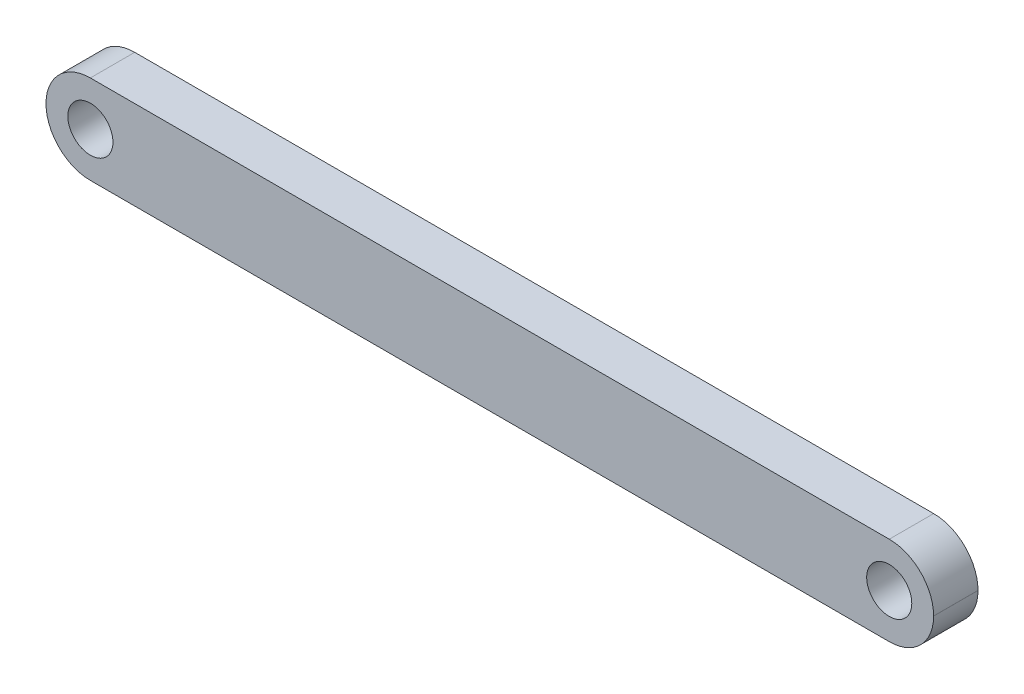
ISO-10303-21;
HEADER;
FILE_DESCRIPTION(('STEP AP214'),'2;1');
FILE_NAME('part.step','',(''),(''),'','','');
FILE_SCHEMA(('AUTOMOTIVE_DESIGN { 1 0 10303 214 1 1 1 1 }'));
ENDSEC;
DATA;
#1=APPLICATION_CONTEXT('core data for automotive mechanical design processes');
#2=APPLICATION_PROTOCOL_DEFINITION('international standard','automotive_design',2000,#1);
#3=PRODUCT_CONTEXT('',#1,'mechanical');
#4=PRODUCT('Part','Part','',(#3));
#5=PRODUCT_RELATED_PRODUCT_CATEGORY('part','',(#4));
#6=PRODUCT_DEFINITION_FORMATION('','',#4);
#7=PRODUCT_DEFINITION_CONTEXT('part definition',#1,'design');
#8=PRODUCT_DEFINITION('design','',#6,#7);
#9=PRODUCT_DEFINITION_SHAPE('','',#8);
#10=(LENGTH_UNIT() NAMED_UNIT(*) SI_UNIT(.MILLI.,.METRE.));
#11=(NAMED_UNIT(*) PLANE_ANGLE_UNIT() SI_UNIT($,.RADIAN.));
#12=(NAMED_UNIT(*) SI_UNIT($,.STERADIAN.) SOLID_ANGLE_UNIT());
#13=UNCERTAINTY_MEASURE_WITH_UNIT(LENGTH_MEASURE(1.E-05),#10,'distance_accuracy_value','');
#14=(GEOMETRIC_REPRESENTATION_CONTEXT(3) GLOBAL_UNCERTAINTY_ASSIGNED_CONTEXT((#13)) GLOBAL_UNIT_ASSIGNED_CONTEXT((#10,
#11,#12)) REPRESENTATION_CONTEXT('',''));
#15=CARTESIAN_POINT('',(0.,0.,0.));
#16=DIRECTION('',(0.,0.,1.));
#17=DIRECTION('',(1.,0.,0.));
#18=AXIS2_PLACEMENT_3D('',#15,#16,#17);
#19=CARTESIAN_POINT('',(12.49,12.51,12.5));
#20=DIRECTION('',(0.,0.,-1.));
#21=DIRECTION('',(-1.,0.,0.));
#22=AXIS2_PLACEMENT_3D('',#19,#20,#21);
#23=CYLINDRICAL_SURFACE('',#22,12.49);
#24=CARTESIAN_POINT('',(12.49,12.51,0.));
#25=DIRECTION('',(0.,0.,1.));
#26=DIRECTION('',(1.,0.,0.));
#27=AXIS2_PLACEMENT_3D('',#24,#25,#26);
#28=CIRCLE('',#27,12.49);
#29=CARTESIAN_POINT('',(0.,12.5099999999999,0.));
#30=VERTEX_POINT('',#29);
#31=CARTESIAN_POINT('',(12.4900000000001,25.,0.));
#32=VERTEX_POINT('',#31);
#33=EDGE_CURVE('E147',#30,#32,#28,.F.);
#34=ORIENTED_EDGE('',*,*,#33,.F.);
#35=DIRECTION('',(0.,0.,-1.));
#36=VECTOR('',#35,1.);
#37=CARTESIAN_POINT('',(0.,12.5099999999999,12.5));
#38=LINE('',#37,#36);
#39=CARTESIAN_POINT('',(0.,12.5099999999999,12.5));
#40=VERTEX_POINT('',#39);
#41=EDGE_CURVE('E11',#40,#30,#38,.T.);
#42=ORIENTED_EDGE('',*,*,#41,.F.);
#43=CARTESIAN_POINT('',(12.49,12.51,12.5));
#44=DIRECTION('',(0.,0.,1.));
#45=DIRECTION('',(1.,0.,0.));
#46=AXIS2_PLACEMENT_3D('',#43,#44,#45);
#47=CIRCLE('',#46,12.49);
#48=CARTESIAN_POINT('',(12.4900000000001,25.,12.5));
#49=VERTEX_POINT('',#48);
#50=EDGE_CURVE('E214',#40,#49,#47,.F.);
#51=ORIENTED_EDGE('',*,*,#50,.T.);
#52=DIRECTION('',(0.,0.,-1.));
#53=VECTOR('',#52,1.);
#54=CARTESIAN_POINT('',(12.4900000000001,25.,12.5));
#55=LINE('',#54,#53);
#56=EDGE_CURVE('E59',#49,#32,#55,.T.);
#57=ORIENTED_EDGE('',*,*,#56,.T.);
#58=EDGE_LOOP('',(#34,#42,#51,#57));
#59=FACE_BOUND('',#58,.T.);
#60=ADVANCED_FACE('F41',(#59),#23,.T.);
#61=CARTESIAN_POINT('',(0.,0.,12.5));
#62=DIRECTION('',(-1.,0.,0.));
#63=DIRECTION('',(0.,0.,1.));
#64=AXIS2_PLACEMENT_3D('',#61,#62,#63);
#65=PLANE('',#64);
#66=DIRECTION('',(0.,1.,0.));
#67=VECTOR('',#66,1.);
#68=CARTESIAN_POINT('',(0.,0.,0.));
#69=LINE('',#68,#67);
#70=CARTESIAN_POINT('',(0.,12.4900000000001,0.));
#71=VERTEX_POINT('',#70);
#72=EDGE_CURVE('E150',#71,#30,#69,.T.);
#73=ORIENTED_EDGE('',*,*,#72,.F.);
#74=DIRECTION('',(0.,0.,-1.));
#75=VECTOR('',#74,1.);
#76=CARTESIAN_POINT('',(0.,12.4900000000001,12.5));
#77=LINE('',#76,#75);
#78=CARTESIAN_POINT('',(0.,12.4900000000001,12.5));
#79=VERTEX_POINT('',#78);
#80=EDGE_CURVE('E51',#79,#71,#77,.T.);
#81=ORIENTED_EDGE('',*,*,#80,.F.);
#82=DIRECTION('',(0.,1.,0.));
#83=VECTOR('',#82,1.);
#84=CARTESIAN_POINT('',(0.,0.,12.5));
#85=LINE('',#84,#83);
#86=EDGE_CURVE('E210',#79,#40,#85,.T.);
#87=ORIENTED_EDGE('',*,*,#86,.T.);
#88=ORIENTED_EDGE('',*,*,#41,.T.);
#89=EDGE_LOOP('',(#73,#81,#87,#88));
#90=FACE_BOUND('',#89,.T.);
#91=ADVANCED_FACE('F199',(#90),#65,.T.);
#92=CARTESIAN_POINT('',(12.49,12.49,12.5));
#93=DIRECTION('',(0.,0.,-1.));
#94=DIRECTION('',(-1.,0.,0.));
#95=AXIS2_PLACEMENT_3D('',#92,#93,#94);
#96=CYLINDRICAL_SURFACE('',#95,12.49);
#97=CARTESIAN_POINT('',(12.49,12.49,0.));
#98=DIRECTION('',(0.,0.,1.));
#99=DIRECTION('',(1.,0.,0.));
#100=AXIS2_PLACEMENT_3D('',#97,#98,#99);
#101=CIRCLE('',#100,12.49);
#102=CARTESIAN_POINT('',(12.4900000000001,0.,0.));
#103=VERTEX_POINT('',#102);
#104=EDGE_CURVE('E154',#103,#71,#101,.F.);
#105=ORIENTED_EDGE('',*,*,#104,.F.);
#106=DIRECTION('',(0.,0.,-1.));
#107=VECTOR('',#106,1.);
#108=CARTESIAN_POINT('',(12.4900000000001,0.,12.5));
#109=LINE('',#108,#107);
#110=CARTESIAN_POINT('',(12.4900000000001,0.,12.5));
#111=VERTEX_POINT('',#110);
#112=EDGE_CURVE('E186',#111,#103,#109,.T.);
#113=ORIENTED_EDGE('',*,*,#112,.F.);
#114=CARTESIAN_POINT('',(12.49,12.49,12.5));
#115=DIRECTION('',(0.,0.,1.));
#116=DIRECTION('',(1.,0.,0.));
#117=AXIS2_PLACEMENT_3D('',#114,#115,#116);
#118=CIRCLE('',#117,12.49);
#119=EDGE_CURVE('E195',#111,#79,#118,.F.);
#120=ORIENTED_EDGE('',*,*,#119,.T.);
#121=ORIENTED_EDGE('',*,*,#80,.T.);
#122=EDGE_LOOP('',(#105,#113,#120,#121));
#123=FACE_BOUND('',#122,.T.);
#124=ADVANCED_FACE('F193',(#123),#96,.T.);
#125=CARTESIAN_POINT('',(0.,0.,12.5));
#126=DIRECTION('',(0.,1.,0.));
#127=DIRECTION('',(0.,0.,1.));
#128=AXIS2_PLACEMENT_3D('',#125,#126,#127);
#129=PLANE('',#128);
#130=DIRECTION('',(1.,0.,0.));
#131=VECTOR('',#130,1.);
#132=CARTESIAN_POINT('',(0.,0.,0.));
#133=LINE('',#132,#131);
#134=CARTESIAN_POINT('',(237.51,0.,0.));
#135=VERTEX_POINT('',#134);
#136=EDGE_CURVE('E158',#103,#135,#133,.T.);
#137=ORIENTED_EDGE('',*,*,#136,.T.);
#138=DIRECTION('',(0.,0.,-1.));
#139=VECTOR('',#138,1.);
#140=CARTESIAN_POINT('',(237.51,0.,12.5));
#141=LINE('',#140,#139);
#142=CARTESIAN_POINT('',(237.51,0.,12.5));
#143=VERTEX_POINT('',#142);
#144=EDGE_CURVE('E182',#143,#135,#141,.T.);
#145=ORIENTED_EDGE('',*,*,#144,.F.);
#146=DIRECTION('',(1.,0.,0.));
#147=VECTOR('',#146,1.);
#148=CARTESIAN_POINT('',(0.,0.,12.5));
#149=LINE('',#148,#147);
#150=EDGE_CURVE('E207',#111,#143,#149,.T.);
#151=ORIENTED_EDGE('',*,*,#150,.F.);
#152=ORIENTED_EDGE('',*,*,#112,.T.);
#153=EDGE_LOOP('',(#137,#145,#151,#152));
#154=FACE_BOUND('',#153,.T.);
#155=ADVANCED_FACE('F205',(#154),#129,.F.);
#156=CARTESIAN_POINT('',(237.51,12.49,12.5));
#157=DIRECTION('',(0.,0.,-1.));
#158=DIRECTION('',(-1.,0.,0.));
#159=AXIS2_PLACEMENT_3D('',#156,#157,#158);
#160=CYLINDRICAL_SURFACE('',#159,12.49);
#161=CARTESIAN_POINT('',(237.51,12.49,0.));
#162=DIRECTION('',(0.,0.,1.));
#163=DIRECTION('',(1.,0.,0.));
#164=AXIS2_PLACEMENT_3D('',#161,#162,#163);
#165=CIRCLE('',#164,12.49);
#166=CARTESIAN_POINT('',(250.,12.4900000000001,0.));
#167=VERTEX_POINT('',#166);
#168=EDGE_CURVE('E162',#135,#167,#165,.T.);
#169=ORIENTED_EDGE('',*,*,#168,.T.);
#170=DIRECTION('',(0.,0.,-1.));
#171=VECTOR('',#170,1.);
#172=CARTESIAN_POINT('',(250.,12.4900000000001,12.5));
#173=LINE('',#172,#171);
#174=CARTESIAN_POINT('',(250.,12.4900000000001,12.5));
#175=VERTEX_POINT('',#174);
#176=EDGE_CURVE('E129',#175,#167,#173,.T.);
#177=ORIENTED_EDGE('',*,*,#176,.F.);
#178=CARTESIAN_POINT('',(237.51,12.49,12.5));
#179=DIRECTION('',(0.,0.,1.));
#180=DIRECTION('',(1.,0.,0.));
#181=AXIS2_PLACEMENT_3D('',#178,#179,#180);
#182=CIRCLE('',#181,12.49);
#183=EDGE_CURVE('E116',#143,#175,#182,.T.);
#184=ORIENTED_EDGE('',*,*,#183,.F.);
#185=ORIENTED_EDGE('',*,*,#144,.T.);
#186=EDGE_LOOP('',(#169,#177,#184,#185));
#187=FACE_BOUND('',#186,.T.);
#188=ADVANCED_FACE('F258',(#187),#160,.T.);
#189=CARTESIAN_POINT('',(250.,0.,12.5));
#190=DIRECTION('',(-1.,0.,0.));
#191=DIRECTION('',(0.,0.,1.));
#192=AXIS2_PLACEMENT_3D('',#189,#190,#191);
#193=PLANE('',#192);
#194=DIRECTION('',(0.,1.,0.));
#195=VECTOR('',#194,1.);
#196=CARTESIAN_POINT('',(250.,0.,0.));
#197=LINE('',#196,#195);
#198=CARTESIAN_POINT('',(250.,12.5099999999999,0.));
#199=VERTEX_POINT('',#198);
#200=EDGE_CURVE('E125',#167,#199,#197,.T.);
#201=ORIENTED_EDGE('',*,*,#200,.T.);
#202=DIRECTION('',(0.,0.,-1.));
#203=VECTOR('',#202,1.);
#204=CARTESIAN_POINT('',(250.,12.5099999999999,12.5));
#205=LINE('',#204,#203);
#206=CARTESIAN_POINT('',(250.,12.5099999999999,12.5));
#207=VERTEX_POINT('',#206);
#208=EDGE_CURVE('E123',#207,#199,#205,.T.);
#209=ORIENTED_EDGE('',*,*,#208,.F.);
#210=DIRECTION('',(0.,1.,0.));
#211=VECTOR('',#210,1.);
#212=CARTESIAN_POINT('',(250.,0.,12.5));
#213=LINE('',#212,#211);
#214=EDGE_CURVE('E109',#175,#207,#213,.T.);
#215=ORIENTED_EDGE('',*,*,#214,.F.);
#216=ORIENTED_EDGE('',*,*,#176,.T.);
#217=EDGE_LOOP('',(#201,#209,#215,#216));
#218=FACE_BOUND('',#217,.T.);
#219=ADVANCED_FACE('F124',(#218),#193,.F.);
#220=CARTESIAN_POINT('',(237.51,12.51,12.5));
#221=DIRECTION('',(0.,0.,-1.));
#222=DIRECTION('',(-1.,0.,0.));
#223=AXIS2_PLACEMENT_3D('',#220,#221,#222);
#224=CYLINDRICAL_SURFACE('',#223,12.49);
#225=CARTESIAN_POINT('',(237.51,12.51,0.));
#226=DIRECTION('',(0.,0.,1.));
#227=DIRECTION('',(1.,0.,0.));
#228=AXIS2_PLACEMENT_3D('',#225,#226,#227);
#229=CIRCLE('',#228,12.49);
#230=CARTESIAN_POINT('',(237.51,25.,0.));
#231=VERTEX_POINT('',#230);
#232=EDGE_CURVE('E168',#231,#199,#229,.F.);
#233=ORIENTED_EDGE('',*,*,#232,.F.);
#234=DIRECTION('',(0.,0.,-1.));
#235=VECTOR('',#234,1.);
#236=CARTESIAN_POINT('',(237.51,25.,12.5));
#237=LINE('',#236,#235);
#238=CARTESIAN_POINT('',(237.51,25.,12.5));
#239=VERTEX_POINT('',#238);
#240=EDGE_CURVE('E84',#239,#231,#237,.T.);
#241=ORIENTED_EDGE('',*,*,#240,.F.);
#242=CARTESIAN_POINT('',(237.51,12.51,12.5));
#243=DIRECTION('',(0.,0.,1.));
#244=DIRECTION('',(1.,0.,0.));
#245=AXIS2_PLACEMENT_3D('',#242,#243,#244);
#246=CIRCLE('',#245,12.49);
#247=EDGE_CURVE('E114',#239,#207,#246,.F.);
#248=ORIENTED_EDGE('',*,*,#247,.T.);
#249=ORIENTED_EDGE('',*,*,#208,.T.);
#250=EDGE_LOOP('',(#233,#241,#248,#249));
#251=FACE_BOUND('',#250,.T.);
#252=ADVANCED_FACE('F131',(#251),#224,.T.);
#253=CARTESIAN_POINT('',(237.5,12.5,12.5));
#254=DIRECTION('',(0.,0.,-1.));
#255=DIRECTION('',(-1.,0.,0.));
#256=AXIS2_PLACEMENT_3D('',#253,#254,#255);
#257=CYLINDRICAL_SURFACE('',#256,6.35);
#258=CARTESIAN_POINT('',(237.5,12.5,12.5));
#259=DIRECTION('',(0.,0.,1.));
#260=DIRECTION('',(1.,0.,0.));
#261=AXIS2_PLACEMENT_3D('',#258,#259,#260);
#262=CIRCLE('',#261,6.35);
#263=CARTESIAN_POINT('',(243.85,12.5,12.5));
#264=VERTEX_POINT('',#263);
#265=EDGE_CURVE('E220',#264,#264,#262,.T.);
#266=ORIENTED_EDGE('',*,*,#265,.T.);
#267=EDGE_LOOP('',(#266));
#268=FACE_BOUND('',#267,.T.);
#269=CARTESIAN_POINT('',(237.5,12.5,0.));
#270=DIRECTION('',(0.,0.,1.));
#271=DIRECTION('',(1.,0.,0.));
#272=AXIS2_PLACEMENT_3D('',#269,#270,#271);
#273=CIRCLE('',#272,6.35);
#274=CARTESIAN_POINT('',(243.85,12.5,0.));
#275=VERTEX_POINT('',#274);
#276=EDGE_CURVE('E143',#275,#275,#273,.T.);
#277=ORIENTED_EDGE('',*,*,#276,.F.);
#278=EDGE_LOOP('',(#277));
#279=FACE_BOUND('',#278,.T.);
#280=ADVANCED_FACE('F236',(#268,#279),#257,.F.);
#281=CARTESIAN_POINT('',(12.5,12.5,12.5));
#282=DIRECTION('',(0.,0.,-1.));
#283=DIRECTION('',(-1.,0.,0.));
#284=AXIS2_PLACEMENT_3D('',#281,#282,#283);
#285=CYLINDRICAL_SURFACE('',#284,6.35);
#286=CARTESIAN_POINT('',(12.5,12.5,12.5));
#287=DIRECTION('',(0.,0.,1.));
#288=DIRECTION('',(1.,0.,0.));
#289=AXIS2_PLACEMENT_3D('',#286,#287,#288);
#290=CIRCLE('',#289,6.35);
#291=CARTESIAN_POINT('',(18.85,12.5,12.5));
#292=VERTEX_POINT('',#291);
#293=EDGE_CURVE('E175',#292,#292,#290,.T.);
#294=ORIENTED_EDGE('',*,*,#293,.T.);
#295=EDGE_LOOP('',(#294));
#296=FACE_BOUND('',#295,.T.);
#297=CARTESIAN_POINT('',(12.5,12.5,0.));
#298=DIRECTION('',(0.,0.,1.));
#299=DIRECTION('',(1.,0.,0.));
#300=AXIS2_PLACEMENT_3D('',#297,#298,#299);
#301=CIRCLE('',#300,6.35);
#302=CARTESIAN_POINT('',(18.85,12.5,0.));
#303=VERTEX_POINT('',#302);
#304=EDGE_CURVE('E139',#303,#303,#301,.T.);
#305=ORIENTED_EDGE('',*,*,#304,.F.);
#306=EDGE_LOOP('',(#305));
#307=FACE_BOUND('',#306,.T.);
#308=ADVANCED_FACE('F43',(#296,#307),#285,.F.);
#309=CARTESIAN_POINT('',(0.,25.,12.5));
#310=DIRECTION('',(0.,1.,0.));
#311=DIRECTION('',(0.,0.,1.));
#312=AXIS2_PLACEMENT_3D('',#309,#310,#311);
#313=PLANE('',#312);
#314=DIRECTION('',(1.,0.,0.));
#315=VECTOR('',#314,1.);
#316=CARTESIAN_POINT('',(0.,25.,0.));
#317=LINE('',#316,#315);
#318=EDGE_CURVE('E171',#32,#231,#317,.T.);
#319=ORIENTED_EDGE('',*,*,#318,.F.);
#320=ORIENTED_EDGE('',*,*,#56,.F.);
#321=DIRECTION('',(1.,0.,0.));
#322=VECTOR('',#321,1.);
#323=CARTESIAN_POINT('',(0.,25.,12.5));
#324=LINE('',#323,#322);
#325=EDGE_CURVE('E133',#49,#239,#324,.T.);
#326=ORIENTED_EDGE('',*,*,#325,.T.);
#327=ORIENTED_EDGE('',*,*,#240,.T.);
#328=EDGE_LOOP('',(#319,#320,#326,#327));
#329=FACE_BOUND('',#328,.T.);
#330=ADVANCED_FACE('F232',(#329),#313,.T.);
#331=CARTESIAN_POINT('',(0.,0.,12.5));
#332=DIRECTION('',(0.,0.,1.));
#333=DIRECTION('',(1.,0.,0.));
#334=AXIS2_PLACEMENT_3D('',#331,#332,#333);
#335=PLANE('',#334);
#336=ORIENTED_EDGE('',*,*,#293,.F.);
#337=EDGE_LOOP('',(#336));
#338=FACE_BOUND('',#337,.T.);
#339=ORIENTED_EDGE('',*,*,#265,.F.);
#340=EDGE_LOOP('',(#339));
#341=FACE_BOUND('',#340,.T.);
#342=ORIENTED_EDGE('',*,*,#50,.F.);
#343=ORIENTED_EDGE('',*,*,#86,.F.);
#344=ORIENTED_EDGE('',*,*,#119,.F.);
#345=ORIENTED_EDGE('',*,*,#150,.T.);
#346=ORIENTED_EDGE('',*,*,#183,.T.);
#347=ORIENTED_EDGE('',*,*,#214,.T.);
#348=ORIENTED_EDGE('',*,*,#247,.F.);
#349=ORIENTED_EDGE('',*,*,#325,.F.);
#350=EDGE_LOOP('',(#342,#343,#344,#345,#346,#347,#348,#349));
#351=FACE_BOUND('',#350,.T.);
#352=ADVANCED_FACE('F111',(#338,#341,#351),#335,.T.);
#353=CARTESIAN_POINT('',(0.,0.,0.));
#354=DIRECTION('',(0.,0.,1.));
#355=DIRECTION('',(1.,0.,0.));
#356=AXIS2_PLACEMENT_3D('',#353,#354,#355);
#357=PLANE('',#356);
#358=ORIENTED_EDGE('',*,*,#304,.T.);
#359=EDGE_LOOP('',(#358));
#360=FACE_BOUND('',#359,.T.);
#361=ORIENTED_EDGE('',*,*,#276,.T.);
#362=EDGE_LOOP('',(#361));
#363=FACE_BOUND('',#362,.T.);
#364=ORIENTED_EDGE('',*,*,#33,.T.);
#365=ORIENTED_EDGE('',*,*,#318,.T.);
#366=ORIENTED_EDGE('',*,*,#232,.T.);
#367=ORIENTED_EDGE('',*,*,#200,.F.);
#368=ORIENTED_EDGE('',*,*,#168,.F.);
#369=ORIENTED_EDGE('',*,*,#136,.F.);
#370=ORIENTED_EDGE('',*,*,#104,.T.);
#371=ORIENTED_EDGE('',*,*,#72,.T.);
#372=EDGE_LOOP('',(#364,#365,#366,#367,#368,#369,#370,#371));
#373=FACE_BOUND('',#372,.T.);
#374=ADVANCED_FACE('F202',(#360,#363,#373),#357,.F.);
#375=CLOSED_SHELL('',(#60,#91,#124,#155,#188,#219,#252,#280,#308,#330,#352,#374));
#376=MANIFOLD_SOLID_BREP('B2',#375);
#377=ADVANCED_BREP_SHAPE_REPRESENTATION('',(#18,#376),#14);
#378=SHAPE_DEFINITION_REPRESENTATION(#9,#377);
ENDSEC;
END-ISO-10303-21;
